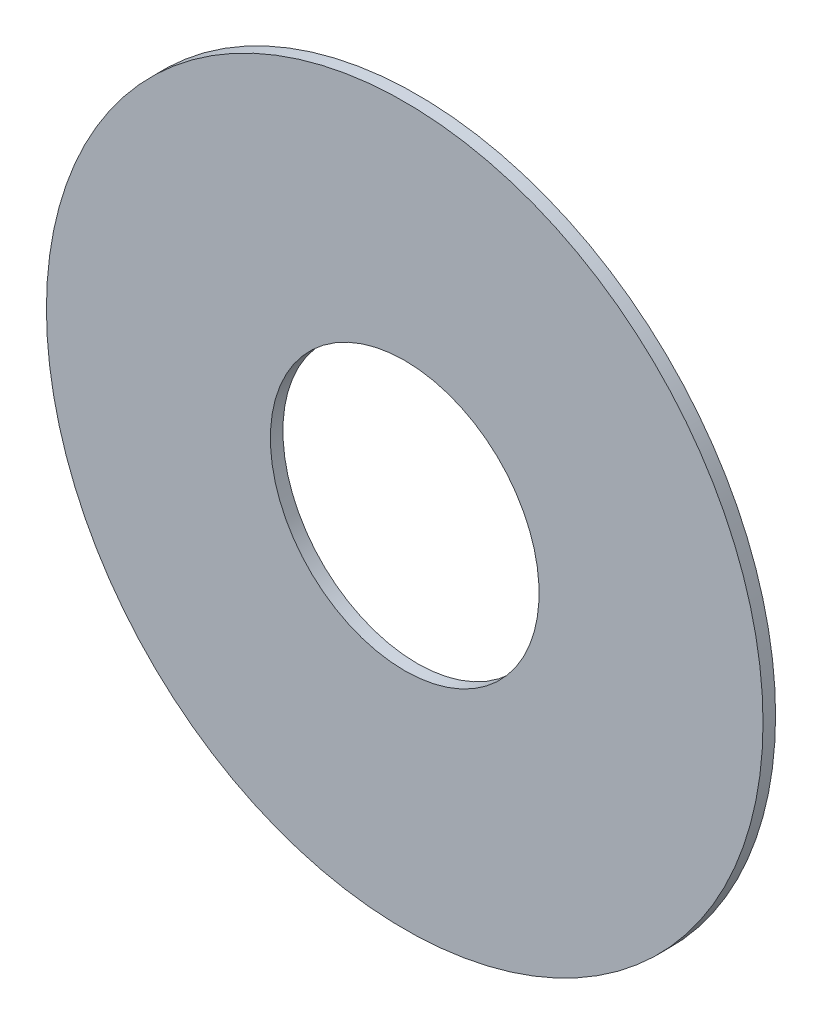
ISO-10303-21;
HEADER;
FILE_DESCRIPTION(('STEP AP214'),'2;1');
FILE_NAME('part.step','',(''),(''),'','','');
FILE_SCHEMA(('AUTOMOTIVE_DESIGN { 1 0 10303 214 1 1 1 1 }'));
ENDSEC;
DATA;
#1=APPLICATION_CONTEXT('core data for automotive mechanical design processes');
#2=APPLICATION_PROTOCOL_DEFINITION('international standard','automotive_design',2000,#1);
#3=PRODUCT_CONTEXT('',#1,'mechanical');
#4=PRODUCT('Part','Part','',(#3));
#5=PRODUCT_RELATED_PRODUCT_CATEGORY('part','',(#4));
#6=PRODUCT_DEFINITION_FORMATION('','',#4);
#7=PRODUCT_DEFINITION_CONTEXT('part definition',#1,'design');
#8=PRODUCT_DEFINITION('design','',#6,#7);
#9=PRODUCT_DEFINITION_SHAPE('','',#8);
#10=(LENGTH_UNIT() NAMED_UNIT(*) SI_UNIT(.MILLI.,.METRE.));
#11=(NAMED_UNIT(*) PLANE_ANGLE_UNIT() SI_UNIT($,.RADIAN.));
#12=(NAMED_UNIT(*) SI_UNIT($,.STERADIAN.) SOLID_ANGLE_UNIT());
#13=UNCERTAINTY_MEASURE_WITH_UNIT(LENGTH_MEASURE(1.E-05),#10,'distance_accuracy_value','');
#14=(GEOMETRIC_REPRESENTATION_CONTEXT(3) GLOBAL_UNCERTAINTY_ASSIGNED_CONTEXT((#13)) GLOBAL_UNIT_ASSIGNED_CONTEXT((#10,
#11,#12)) REPRESENTATION_CONTEXT('',''));
#15=CARTESIAN_POINT('',(0.,0.,0.));
#16=DIRECTION('',(0.,0.,1.));
#17=DIRECTION('',(1.,0.,0.));
#18=AXIS2_PLACEMENT_3D('',#15,#16,#17);
#19=CARTESIAN_POINT('',(143.764,-73.152,-0.045));
#20=DIRECTION('',(0.,0.,-1.));
#21=DIRECTION('',(0.,-1.,0.));
#22=AXIS2_PLACEMENT_3D('',#19,#20,#21);
#23=CYLINDRICAL_SURFACE('',#22,0.375);
#24=CARTESIAN_POINT('',(143.764,-73.152,-0.035));
#25=DIRECTION('',(0.,0.,-1.));
#26=DIRECTION('',(0.,-1.,0.));
#27=AXIS2_PLACEMENT_3D('',#24,#25,#26);
#28=CIRCLE('',#27,0.375);
#29=CARTESIAN_POINT('',(143.764,-73.527,-0.035));
#30=VERTEX_POINT('',#29);
#31=EDGE_CURVE('E25',#30,#30,#28,.T.);
#32=ORIENTED_EDGE('',*,*,#31,.T.);
#33=DIRECTION('',(0.,0.,1.));
#34=VECTOR('',#33,1.);
#35=CARTESIAN_POINT('',(143.764,-73.527,-0.045));
#36=LINE('',#35,#34);
#37=CARTESIAN_POINT('',(143.764,-73.527,0.));
#38=VERTEX_POINT('',#37);
#39=EDGE_CURVE('E11',#30,#38,#36,.T.);
#40=ORIENTED_EDGE('',*,*,#39,.T.);
#41=CARTESIAN_POINT('',(143.764,-73.152,0.));
#42=DIRECTION('',(0.,0.,-1.));
#43=DIRECTION('',(0.,-1.,0.));
#44=AXIS2_PLACEMENT_3D('',#41,#42,#43);
#45=CIRCLE('',#44,0.375);
#46=EDGE_CURVE('E68',#38,#38,#45,.T.);
#47=ORIENTED_EDGE('',*,*,#46,.F.);
#48=ORIENTED_EDGE('',*,*,#39,.F.);
#49=EDGE_LOOP('',(#32,#40,#47,#48));
#50=FACE_BOUND('',#49,.T.);
#51=ADVANCED_FACE('F17',(#50),#23,.F.);
#52=CARTESIAN_POINT('',(143.764,-73.152,-0.035));
#53=DIRECTION('',(0.,0.,1.));
#54=DIRECTION('',(1.,0.,0.));
#55=AXIS2_PLACEMENT_3D('',#52,#53,#54);
#56=PLANE('',#55);
#57=ORIENTED_EDGE('',*,*,#31,.F.);
#58=EDGE_LOOP('',(#57));
#59=FACE_BOUND('',#58,.T.);
#60=CARTESIAN_POINT('',(143.764,-73.152,-0.035));
#61=DIRECTION('',(0.,0.,1.));
#62=DIRECTION('',(1.,0.,0.));
#63=AXIS2_PLACEMENT_3D('',#60,#61,#62);
#64=CIRCLE('',#63,1.);
#65=CARTESIAN_POINT('',(144.764,-73.152,-0.035));
#66=VERTEX_POINT('',#65);
#67=EDGE_CURVE('E55',#66,#66,#64,.T.);
#68=ORIENTED_EDGE('',*,*,#67,.F.);
#69=EDGE_LOOP('',(#68));
#70=FACE_BOUND('',#69,.T.);
#71=ADVANCED_FACE('F75',(#59,#70),#56,.F.);
#72=CARTESIAN_POINT('',(143.764,-73.152,0.));
#73=DIRECTION('',(0.,0.,1.));
#74=DIRECTION('',(1.,0.,0.));
#75=AXIS2_PLACEMENT_3D('',#72,#73,#74);
#76=PLANE('',#75);
#77=ORIENTED_EDGE('',*,*,#46,.T.);
#78=EDGE_LOOP('',(#77));
#79=FACE_BOUND('',#78,.T.);
#80=CARTESIAN_POINT('',(143.764,-73.152,0.));
#81=DIRECTION('',(0.,0.,1.));
#82=DIRECTION('',(1.,0.,0.));
#83=AXIS2_PLACEMENT_3D('',#80,#81,#82);
#84=CIRCLE('',#83,1.);
#85=CARTESIAN_POINT('',(144.764,-73.152,0.));
#86=VERTEX_POINT('',#85);
#87=EDGE_CURVE('E53',#86,#86,#84,.T.);
#88=ORIENTED_EDGE('',*,*,#87,.T.);
#89=EDGE_LOOP('',(#88));
#90=FACE_BOUND('',#89,.T.);
#91=ADVANCED_FACE('F59',(#79,#90),#76,.T.);
#92=CARTESIAN_POINT('',(143.764,-73.152,-0.035));
#93=DIRECTION('',(0.,0.,1.));
#94=DIRECTION('',(1.,0.,0.));
#95=AXIS2_PLACEMENT_3D('',#92,#93,#94);
#96=CYLINDRICAL_SURFACE('',#95,1.);
#97=ORIENTED_EDGE('',*,*,#87,.F.);
#98=DIRECTION('',(0.,0.,1.));
#99=VECTOR('',#98,1.);
#100=CARTESIAN_POINT('',(144.764,-73.152,-0.035));
#101=LINE('',#100,#99);
#102=EDGE_CURVE('E50',#66,#86,#101,.T.);
#103=ORIENTED_EDGE('',*,*,#102,.F.);
#104=ORIENTED_EDGE('',*,*,#67,.T.);
#105=ORIENTED_EDGE('',*,*,#102,.T.);
#106=EDGE_LOOP('',(#97,#103,#104,#105));
#107=FACE_BOUND('',#106,.T.);
#108=ADVANCED_FACE('F52',(#107),#96,.T.);
#109=CLOSED_SHELL('',(#51,#71,#91,#108));
#110=MANIFOLD_SOLID_BREP('B1',#109);
#111=ADVANCED_BREP_SHAPE_REPRESENTATION('',(#18,#110),#14);
#112=SHAPE_DEFINITION_REPRESENTATION(#9,#111);
ENDSEC;
END-ISO-10303-21;
